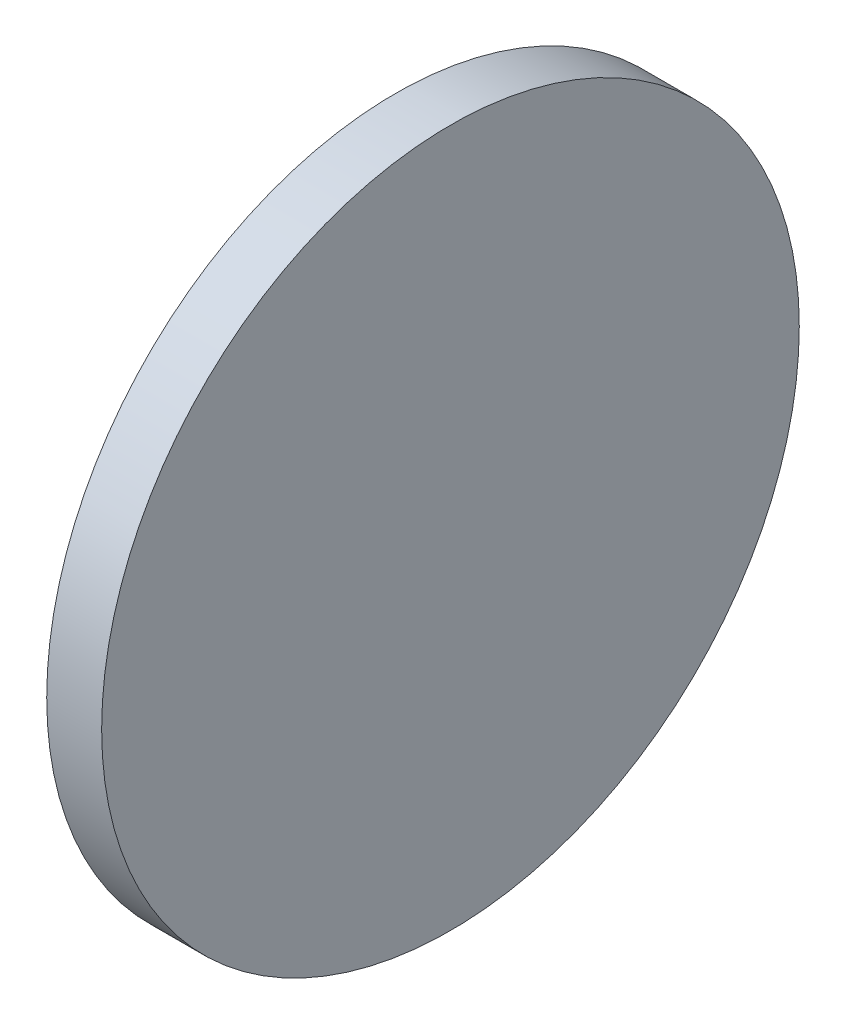
ISO-10303-21;
HEADER;
FILE_DESCRIPTION(('STEP AP214'),'2;1');
FILE_NAME('part.step','',(''),(''),'','','');
FILE_SCHEMA(('AUTOMOTIVE_DESIGN { 1 0 10303 214 1 1 1 1 }'));
ENDSEC;
DATA;
#1=APPLICATION_CONTEXT('core data for automotive mechanical design processes');
#2=APPLICATION_PROTOCOL_DEFINITION('international standard','automotive_design',2000,#1);
#3=PRODUCT_CONTEXT('',#1,'mechanical');
#4=PRODUCT('Part','Part','',(#3));
#5=PRODUCT_RELATED_PRODUCT_CATEGORY('part','',(#4));
#6=PRODUCT_DEFINITION_FORMATION('','',#4);
#7=PRODUCT_DEFINITION_CONTEXT('part definition',#1,'design');
#8=PRODUCT_DEFINITION('design','',#6,#7);
#9=PRODUCT_DEFINITION_SHAPE('','',#8);
#10=(LENGTH_UNIT() NAMED_UNIT(*) SI_UNIT(.MILLI.,.METRE.));
#11=(NAMED_UNIT(*) PLANE_ANGLE_UNIT() SI_UNIT($,.RADIAN.));
#12=(NAMED_UNIT(*) SI_UNIT($,.STERADIAN.) SOLID_ANGLE_UNIT());
#13=UNCERTAINTY_MEASURE_WITH_UNIT(LENGTH_MEASURE(1.E-05),#10,'distance_accuracy_value','');
#14=(GEOMETRIC_REPRESENTATION_CONTEXT(3) GLOBAL_UNCERTAINTY_ASSIGNED_CONTEXT((#13)) GLOBAL_UNIT_ASSIGNED_CONTEXT((#10,
#11,#12)) REPRESENTATION_CONTEXT('',''));
#15=CARTESIAN_POINT('',(0.,0.,0.));
#16=DIRECTION('',(0.,0.,1.));
#17=DIRECTION('',(1.,0.,0.));
#18=AXIS2_PLACEMENT_3D('',#15,#16,#17);
#19=CARTESIAN_POINT('',(117.764555476201,65.2335549264122,0.));
#20=DIRECTION('',(-1.,0.,0.));
#21=DIRECTION('',(0.,0.,1.));
#22=AXIS2_PLACEMENT_3D('',#19,#20,#21);
#23=PLANE('',#22);
#24=CARTESIAN_POINT('',(117.764555476201,65.2335549264122,0.));
#25=DIRECTION('',(-1.,0.,0.));
#26=DIRECTION('',(0.,0.,1.));
#27=AXIS2_PLACEMENT_3D('',#24,#25,#26);
#28=CIRCLE('',#27,12.7);
#29=CARTESIAN_POINT('',(117.764555476201,65.2335549264122,12.7));
#30=VERTEX_POINT('',#29);
#31=EDGE_CURVE('E10',#30,#30,#28,.T.);
#32=ORIENTED_EDGE('',*,*,#31,.F.);
#33=EDGE_LOOP('',(#32));
#34=FACE_BOUND('',#33,.T.);
#35=ADVANCED_FACE('F35',(#34),#23,.F.);
#36=CARTESIAN_POINT('',(110.165373228488,65.2335549264122,0.));
#37=DIRECTION('',(-1.,0.,0.));
#38=DIRECTION('',(0.,0.,1.));
#39=AXIS2_PLACEMENT_3D('',#36,#37,#38);
#40=CYLINDRICAL_SURFACE('',#39,12.7);
#41=CARTESIAN_POINT('',(115.764555476201,65.2335549264122,0.));
#42=DIRECTION('',(-1.,0.,0.));
#43=DIRECTION('',(0.,0.,1.));
#44=AXIS2_PLACEMENT_3D('',#41,#42,#43);
#45=CIRCLE('',#44,12.7);
#46=CARTESIAN_POINT('',(115.764555476201,65.2335549264122,12.7));
#47=VERTEX_POINT('',#46);
#48=EDGE_CURVE('E41',#47,#47,#45,.T.);
#49=ORIENTED_EDGE('',*,*,#48,.F.);
#50=EDGE_LOOP('',(#49));
#51=FACE_BOUND('',#50,.T.);
#52=ORIENTED_EDGE('',*,*,#31,.T.);
#53=EDGE_LOOP('',(#52));
#54=FACE_BOUND('',#53,.T.);
#55=ADVANCED_FACE('F49',(#51,#54),#40,.T.);
#56=CARTESIAN_POINT('',(115.764555476201,65.2335549264122,0.));
#57=DIRECTION('',(1.,0.,0.));
#58=DIRECTION('',(0.,0.,-1.));
#59=AXIS2_PLACEMENT_3D('',#56,#57,#58);
#60=PLANE('',#59);
#61=ORIENTED_EDGE('',*,*,#48,.T.);
#62=EDGE_LOOP('',(#61));
#63=FACE_BOUND('',#62,.T.);
#64=ADVANCED_FACE('F47',(#63),#60,.F.);
#65=CLOSED_SHELL('',(#35,#55,#64));
#66=MANIFOLD_SOLID_BREP('B2',#65);
#67=ADVANCED_BREP_SHAPE_REPRESENTATION('',(#18,#66),#14);
#68=SHAPE_DEFINITION_REPRESENTATION(#9,#67);
ENDSEC;
END-ISO-10303-21;
